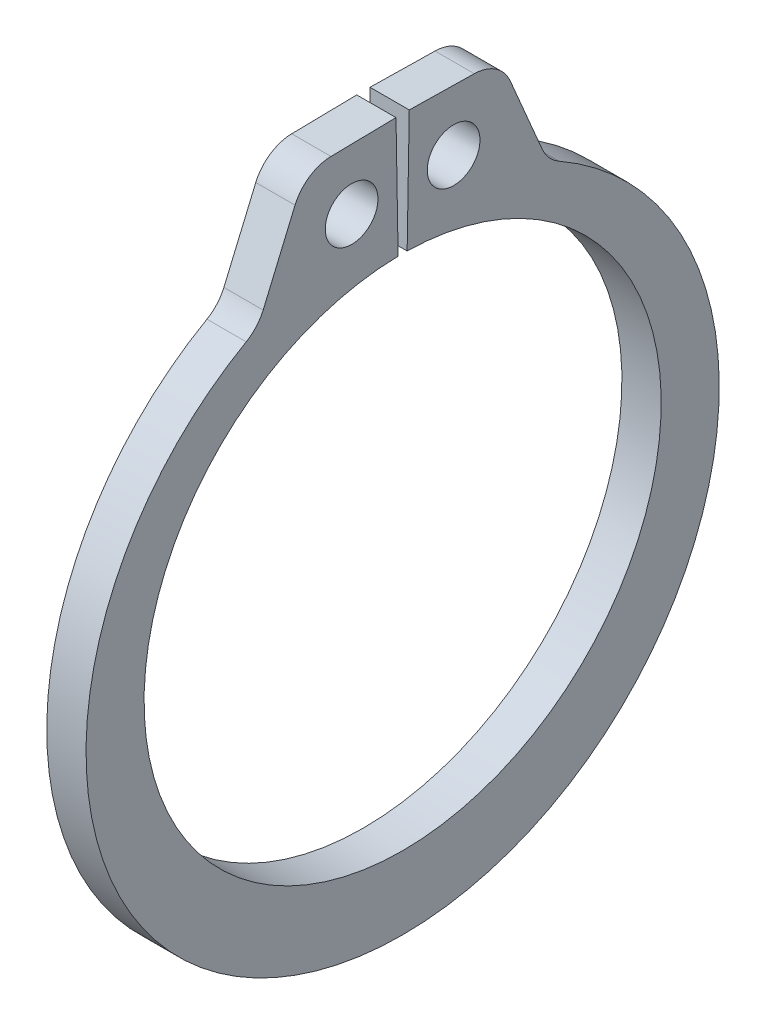
ISO-10303-21;
HEADER;
FILE_DESCRIPTION(('STEP AP214'),'2;1');
FILE_NAME('part.step','',(''),(''),'','','');
FILE_SCHEMA(('AUTOMOTIVE_DESIGN { 1 0 10303 214 1 1 1 1 }'));
ENDSEC;
DATA;
#1=APPLICATION_CONTEXT('core data for automotive mechanical design processes');
#2=APPLICATION_PROTOCOL_DEFINITION('international standard','automotive_design',2000,#1);
#3=PRODUCT_CONTEXT('',#1,'mechanical');
#4=PRODUCT('Part','Part','',(#3));
#5=PRODUCT_RELATED_PRODUCT_CATEGORY('part','',(#4));
#6=PRODUCT_DEFINITION_FORMATION('','',#4);
#7=PRODUCT_DEFINITION_CONTEXT('part definition',#1,'design');
#8=PRODUCT_DEFINITION('design','',#6,#7);
#9=PRODUCT_DEFINITION_SHAPE('','',#8);
#10=(LENGTH_UNIT() NAMED_UNIT(*) SI_UNIT(.MILLI.,.METRE.));
#11=(NAMED_UNIT(*) PLANE_ANGLE_UNIT() SI_UNIT($,.RADIAN.));
#12=(NAMED_UNIT(*) SI_UNIT($,.STERADIAN.) SOLID_ANGLE_UNIT());
#13=UNCERTAINTY_MEASURE_WITH_UNIT(LENGTH_MEASURE(1.E-05),#10,'distance_accuracy_value','');
#14=(GEOMETRIC_REPRESENTATION_CONTEXT(3) GLOBAL_UNCERTAINTY_ASSIGNED_CONTEXT((#13)) GLOBAL_UNIT_ASSIGNED_CONTEXT((#10,
#11,#12)) REPRESENTATION_CONTEXT('',''));
#15=CARTESIAN_POINT('',(0.,0.,0.));
#16=DIRECTION('',(0.,0.,1.));
#17=DIRECTION('',(1.,0.,0.));
#18=AXIS2_PLACEMENT_3D('',#15,#16,#17);
#19=CARTESIAN_POINT('',(-0.4445,0.,0.));
#20=DIRECTION('',(1.,0.,0.));
#21=DIRECTION('',(0.,0.,-1.));
#22=AXIS2_PLACEMENT_3D('',#19,#20,#21);
#23=PLANE('',#22);
#24=CARTESIAN_POINT('',(-0.4445,7.20724610900658,-1.15465964864512));
#25=DIRECTION('',(-1.,0.,0.));
#26=DIRECTION('',(0.,0.,1.));
#27=AXIS2_PLACEMENT_3D('',#24,#25,#26);
#28=CIRCLE('',#27,0.5969);
#29=CARTESIAN_POINT('',(-0.4445,7.20724610900658,-0.557759648645124));
#30=VERTEX_POINT('',#29);
#31=EDGE_CURVE('E134',#30,#30,#28,.F.);
#32=ORIENTED_EDGE('',*,*,#31,.T.);
#33=EDGE_LOOP('',(#32));
#34=FACE_BOUND('',#33,.T.);
#35=CARTESIAN_POINT('',(-0.4445,7.66933071962558,1.60650376158788));
#36=DIRECTION('',(-1.,0.,0.));
#37=DIRECTION('',(0.,0.,1.));
#38=AXIS2_PLACEMENT_3D('',#35,#36,#37);
#39=CIRCLE('',#38,0.9017);
#40=CARTESIAN_POINT('',(-0.4445,8.5708933863481,1.62224059647238));
#41=VERTEX_POINT('',#40);
#42=CARTESIAN_POINT('',(-0.4445,8.02240621636442,2.43620285379096));
#43=VERTEX_POINT('',#42);
#44=EDGE_CURVE('E104',#41,#43,#39,.F.);
#45=ORIENTED_EDGE('',*,*,#44,.F.);
#46=DIRECTION('',(0.,0.01745240643729,-0.999847695156391));
#47=VECTOR('',#46,1.);
#48=CARTESIAN_POINT('',(-0.4445,8.59659049818515,0.15005404530712));
#49=LINE('',#48,#47);
#50=CARTESIAN_POINT('',(-0.4445,8.59659049818515,0.15005404530712));
#51=VERTEX_POINT('',#50);
#52=EDGE_CURVE('E99',#41,#51,#49,.T.);
#53=ORIENTED_EDGE('',*,*,#52,.T.);
#54=DIRECTION('',(0.,-0.999847695156391,-0.0174524064372833));
#55=VECTOR('',#54,1.);
#56=CARTESIAN_POINT('',(-0.4445,5.85380830083213,0.102178603968365));
#57=LINE('',#56,#55);
#58=CARTESIAN_POINT('',(-0.4445,5.85380830083213,0.102178603968365));
#59=VERTEX_POINT('',#58);
#60=EDGE_CURVE('E131',#51,#59,#57,.T.);
#61=ORIENTED_EDGE('',*,*,#60,.T.);
#62=CARTESIAN_POINT('',(-0.4445,0.,0.));
#63=DIRECTION('',(-1.,0.,0.));
#64=DIRECTION('',(0.,0.,1.));
#65=AXIS2_PLACEMENT_3D('',#62,#63,#64);
#66=CIRCLE('',#65,5.8547);
#67=CARTESIAN_POINT('',(-0.4445,5.85380830083213,-0.102178603968365));
#68=VERTEX_POINT('',#67);
#69=EDGE_CURVE('E181',#59,#68,#66,.F.);
#70=ORIENTED_EDGE('',*,*,#69,.T.);
#71=DIRECTION('',(0.,0.999847695156391,-0.0174524064372833));
#72=VECTOR('',#71,1.);
#73=CARTESIAN_POINT('',(-0.4445,5.85380830083213,-0.102178603968365));
#74=LINE('',#73,#72);
#75=CARTESIAN_POINT('',(-0.4445,8.59659049818515,-0.15005404530712));
#76=VERTEX_POINT('',#75);
#77=EDGE_CURVE('E141',#68,#76,#74,.T.);
#78=ORIENTED_EDGE('',*,*,#77,.T.);
#79=DIRECTION('',(0.,-0.01745240643729,-0.999847695156391));
#80=VECTOR('',#79,1.);
#81=CARTESIAN_POINT('',(-0.4445,8.59659049818515,-0.15005404530712));
#82=LINE('',#81,#80);
#83=CARTESIAN_POINT('',(-0.4445,8.5708933863481,-1.62224059647238));
#84=VERTEX_POINT('',#83);
#85=EDGE_CURVE('E148',#76,#84,#82,.T.);
#86=ORIENTED_EDGE('',*,*,#85,.T.);
#87=CARTESIAN_POINT('',(-0.4445,7.66933071962558,-1.60650376158788));
#88=DIRECTION('',(-1.,0.,0.));
#89=DIRECTION('',(0.,0.,1.));
#90=AXIS2_PLACEMENT_3D('',#87,#88,#89);
#91=CIRCLE('',#90,0.9017);
#92=CARTESIAN_POINT('',(-0.4445,8.02240621636442,-2.43620285379096));
#93=VERTEX_POINT('',#92);
#94=EDGE_CURVE('E151',#93,#84,#91,.F.);
#95=ORIENTED_EDGE('',*,*,#94,.F.);
#96=DIRECTION('',(0.,-0.920149819455567,-0.391566481910656));
#97=VECTOR('',#96,1.);
#98=CARTESIAN_POINT('',(-0.4445,8.56068391718107,-2.20714069332188));
#99=LINE('',#98,#97);
#100=CARTESIAN_POINT('',(-0.4445,6.32616456625773,-3.15803245301383));
#101=VERTEX_POINT('',#100);
#102=EDGE_CURVE('E154',#93,#101,#99,.T.);
#103=ORIENTED_EDGE('',*,*,#102,.T.);
#104=CARTESIAN_POINT('',(-0.4445,6.67924006299657,-3.98773154521692));
#105=DIRECTION('',(-1.,0.,0.));
#106=DIRECTION('',(0.,0.,1.));
#107=AXIS2_PLACEMENT_3D('',#104,#105,#106);
#108=CIRCLE('',#107,0.9017);
#109=CARTESIAN_POINT('',(-0.4445,5.89530863003734,-3.54218199868087));
#110=VERTEX_POINT('',#109);
#111=EDGE_CURVE('E187',#101,#110,#108,.F.);
#112=ORIENTED_EDGE('',*,*,#111,.T.);
#113=CARTESIAN_POINT('',(-0.4445,-0.337057291142251,0.));
#114=DIRECTION('',(-1.,0.,0.));
#115=DIRECTION('',(0.,0.,1.));
#116=AXIS2_PLACEMENT_3D('',#113,#114,#115);
#117=CIRCLE('',#116,7.16864270885775);
#118=CARTESIAN_POINT('',(-0.4445,5.89530863003733,3.54218199868087));
#119=VERTEX_POINT('',#118);
#120=EDGE_CURVE('E189',#119,#110,#117,.F.);
#121=ORIENTED_EDGE('',*,*,#120,.F.);
#122=CARTESIAN_POINT('',(-0.4445,6.67924006299657,3.98773154521692));
#123=DIRECTION('',(-1.,0.,0.));
#124=DIRECTION('',(0.,0.,1.));
#125=AXIS2_PLACEMENT_3D('',#122,#123,#124);
#126=CIRCLE('',#125,0.9017);
#127=CARTESIAN_POINT('',(-0.4445,6.32616456625773,3.15803245301383));
#128=VERTEX_POINT('',#127);
#129=EDGE_CURVE('E117',#119,#128,#126,.F.);
#130=ORIENTED_EDGE('',*,*,#129,.T.);
#131=DIRECTION('',(0.,0.920149819455567,-0.391566481910656));
#132=VECTOR('',#131,1.);
#133=CARTESIAN_POINT('',(-0.4445,8.56068391718107,2.20714069332188));
#134=LINE('',#133,#132);
#135=EDGE_CURVE('E114',#128,#43,#134,.T.);
#136=ORIENTED_EDGE('',*,*,#135,.T.);
#137=EDGE_LOOP('',(#45,#53,#61,#70,#78,#86,#95,#103,#112,#121,#130,#136));
#138=FACE_BOUND('',#137,.T.);
#139=CARTESIAN_POINT('',(-0.4445,7.20724610900658,1.15465964864512));
#140=DIRECTION('',(-1.,0.,0.));
#141=DIRECTION('',(0.,0.,1.));
#142=AXIS2_PLACEMENT_3D('',#139,#140,#141);
#143=CIRCLE('',#142,0.5969);
#144=CARTESIAN_POINT('',(-0.4445,7.20724610900658,1.75155964864512));
#145=VERTEX_POINT('',#144);
#146=EDGE_CURVE('E21',#145,#145,#143,.F.);
#147=ORIENTED_EDGE('',*,*,#146,.T.);
#148=EDGE_LOOP('',(#147));
#149=FACE_BOUND('',#148,.T.);
#150=ADVANCED_FACE('F18',(#34,#138,#149),#23,.F.);
#151=CARTESIAN_POINT('',(0.4445,7.20724610900658,1.15465964864512));
#152=DIRECTION('',(-1.,0.,0.));
#153=DIRECTION('',(0.,0.,1.));
#154=AXIS2_PLACEMENT_3D('',#151,#152,#153);
#155=CYLINDRICAL_SURFACE('',#154,0.5969);
#156=CARTESIAN_POINT('',(0.4445,7.20724610900658,1.15465964864512));
#157=DIRECTION('',(-1.,0.,0.));
#158=DIRECTION('',(0.,0.,1.));
#159=AXIS2_PLACEMENT_3D('',#156,#157,#158);
#160=CIRCLE('',#159,0.5969);
#161=CARTESIAN_POINT('',(0.4445,7.20724610900658,1.75155964864512));
#162=VERTEX_POINT('',#161);
#163=EDGE_CURVE('E176',#162,#162,#160,.T.);
#164=ORIENTED_EDGE('',*,*,#163,.F.);
#165=EDGE_LOOP('',(#164));
#166=FACE_BOUND('',#165,.T.);
#167=ORIENTED_EDGE('',*,*,#146,.F.);
#168=EDGE_LOOP('',(#167));
#169=FACE_BOUND('',#168,.T.);
#170=ADVANCED_FACE('F361',(#166,#169),#155,.F.);
#171=CARTESIAN_POINT('',(0.4445,8.59659049818515,0.15005404530712));
#172=DIRECTION('',(0.,-0.999847695156391,-0.01745240643729));
#173=DIRECTION('',(0.,0.01745240643729,-0.999847695156391));
#174=AXIS2_PLACEMENT_3D('',#171,#172,#173);
#175=PLANE('',#174);
#176=DIRECTION('',(-1.,0.,0.));
#177=VECTOR('',#176,1.);
#178=CARTESIAN_POINT('',(0.4445,8.5708933863481,1.62224059647238));
#179=LINE('',#178,#177);
#180=CARTESIAN_POINT('',(0.4445,8.5708933863481,1.62224059647238));
#181=VERTEX_POINT('',#180);
#182=EDGE_CURVE('E111',#181,#41,#179,.T.);
#183=ORIENTED_EDGE('',*,*,#182,.F.);
#184=DIRECTION('',(0.,-0.0174524064372901,0.999847695156391));
#185=VECTOR('',#184,1.);
#186=CARTESIAN_POINT('',(0.4445,8.59659049818515,0.15005404530712));
#187=LINE('',#186,#185);
#188=CARTESIAN_POINT('',(0.4445,8.59659049818515,0.15005404530712));
#189=VERTEX_POINT('',#188);
#190=EDGE_CURVE('E175',#189,#181,#187,.T.);
#191=ORIENTED_EDGE('',*,*,#190,.F.);
#192=DIRECTION('',(1.,0.,0.));
#193=VECTOR('',#192,1.);
#194=CARTESIAN_POINT('',(0.4445,8.59659049818515,0.15005404530712));
#195=LINE('',#194,#193);
#196=EDGE_CURVE('E135',#189,#51,#195,.F.);
#197=ORIENTED_EDGE('',*,*,#196,.T.);
#198=ORIENTED_EDGE('',*,*,#52,.F.);
#199=EDGE_LOOP('',(#183,#191,#197,#198));
#200=FACE_BOUND('',#199,.T.);
#201=ADVANCED_FACE('F239',(#200),#175,.F.);
#202=CARTESIAN_POINT('',(0.4445,7.66933071962558,1.60650376158788));
#203=DIRECTION('',(-1.,0.,0.));
#204=DIRECTION('',(0.,0.,1.));
#205=AXIS2_PLACEMENT_3D('',#202,#203,#204);
#206=CYLINDRICAL_SURFACE('',#205,0.9017);
#207=ORIENTED_EDGE('',*,*,#44,.T.);
#208=DIRECTION('',(1.,0.,0.));
#209=VECTOR('',#208,1.);
#210=CARTESIAN_POINT('',(0.4445,8.02240621636442,2.43620285379096));
#211=LINE('',#210,#209);
#212=CARTESIAN_POINT('',(0.4445,8.02240621636442,2.43620285379096));
#213=VERTEX_POINT('',#212);
#214=EDGE_CURVE('E109',#43,#213,#211,.T.);
#215=ORIENTED_EDGE('',*,*,#214,.T.);
#216=CARTESIAN_POINT('',(0.4445,7.66933071962558,1.60650376158788));
#217=DIRECTION('',(-1.,0.,0.));
#218=DIRECTION('',(0.,0.,1.));
#219=AXIS2_PLACEMENT_3D('',#216,#217,#218);
#220=CIRCLE('',#219,0.9017);
#221=EDGE_CURVE('E173',#181,#213,#220,.F.);
#222=ORIENTED_EDGE('',*,*,#221,.F.);
#223=ORIENTED_EDGE('',*,*,#182,.T.);
#224=EDGE_LOOP('',(#207,#215,#222,#223));
#225=FACE_BOUND('',#224,.T.);
#226=ADVANCED_FACE('F106',(#225),#206,.T.);
#227=CARTESIAN_POINT('',(0.4445,8.56068391718107,2.20714069332188));
#228=DIRECTION('',(0.,-0.391566481910656,-0.920149819455567));
#229=DIRECTION('',(0.,0.920149819455567,-0.391566481910656));
#230=AXIS2_PLACEMENT_3D('',#227,#228,#229);
#231=PLANE('',#230);
#232=DIRECTION('',(-1.,0.,0.));
#233=VECTOR('',#232,1.);
#234=CARTESIAN_POINT('',(0.4445,6.32616456625773,3.15803245301383));
#235=LINE('',#234,#233);
#236=CARTESIAN_POINT('',(0.4445,6.32616456625773,3.15803245301383));
#237=VERTEX_POINT('',#236);
#238=EDGE_CURVE('E128',#128,#237,#235,.F.);
#239=ORIENTED_EDGE('',*,*,#238,.T.);
#240=DIRECTION('',(0.,-0.920149819455566,0.391566481910657));
#241=VECTOR('',#240,1.);
#242=CARTESIAN_POINT('',(0.4445,8.02240621636442,2.43620285379096));
#243=LINE('',#242,#241);
#244=EDGE_CURVE('E123',#213,#237,#243,.T.);
#245=ORIENTED_EDGE('',*,*,#244,.F.);
#246=ORIENTED_EDGE('',*,*,#214,.F.);
#247=ORIENTED_EDGE('',*,*,#135,.F.);
#248=EDGE_LOOP('',(#239,#245,#246,#247));
#249=FACE_BOUND('',#248,.T.);
#250=ADVANCED_FACE('F121',(#249),#231,.F.);
#251=CARTESIAN_POINT('',(0.4445,6.67924006299657,3.98773154521692));
#252=DIRECTION('',(-1.,0.,0.));
#253=DIRECTION('',(0.,0.,1.));
#254=AXIS2_PLACEMENT_3D('',#251,#252,#253);
#255=CYLINDRICAL_SURFACE('',#254,0.9017);
#256=ORIENTED_EDGE('',*,*,#238,.F.);
#257=ORIENTED_EDGE('',*,*,#129,.F.);
#258=DIRECTION('',(-1.,0.,0.));
#259=VECTOR('',#258,1.);
#260=CARTESIAN_POINT('',(0.4445,5.89530863003733,3.54218199868087));
#261=LINE('',#260,#259);
#262=CARTESIAN_POINT('',(0.4445,5.89530863003733,3.54218199868087));
#263=VERTEX_POINT('',#262);
#264=EDGE_CURVE('E192',#263,#119,#261,.T.);
#265=ORIENTED_EDGE('',*,*,#264,.F.);
#266=CARTESIAN_POINT('',(0.4445,6.67924006299657,3.98773154521692));
#267=DIRECTION('',(-1.,0.,0.));
#268=DIRECTION('',(0.,0.,1.));
#269=AXIS2_PLACEMENT_3D('',#266,#267,#268);
#270=CIRCLE('',#269,0.9017);
#271=EDGE_CURVE('E170',#237,#263,#270,.T.);
#272=ORIENTED_EDGE('',*,*,#271,.F.);
#273=EDGE_LOOP('',(#256,#257,#265,#272));
#274=FACE_BOUND('',#273,.T.);
#275=ADVANCED_FACE('F269',(#274),#255,.F.);
#276=CARTESIAN_POINT('',(0.4445,-0.337057291142251,0.));
#277=DIRECTION('',(-1.,0.,0.));
#278=DIRECTION('',(0.,0.,1.));
#279=AXIS2_PLACEMENT_3D('',#276,#277,#278);
#280=CYLINDRICAL_SURFACE('',#279,7.16864270885775);
#281=ORIENTED_EDGE('',*,*,#120,.T.);
#282=DIRECTION('',(-1.,0.,0.));
#283=VECTOR('',#282,1.);
#284=CARTESIAN_POINT('',(0.4445,5.89530863003733,-3.54218199868087));
#285=LINE('',#284,#283);
#286=CARTESIAN_POINT('',(0.4445,5.89530863003734,-3.54218199868087));
#287=VERTEX_POINT('',#286);
#288=EDGE_CURVE('E156',#110,#287,#285,.F.);
#289=ORIENTED_EDGE('',*,*,#288,.T.);
#290=CARTESIAN_POINT('',(0.4445,-0.337057291142251,0.));
#291=DIRECTION('',(-1.,0.,0.));
#292=DIRECTION('',(0.,0.,1.));
#293=AXIS2_PLACEMENT_3D('',#290,#291,#292);
#294=CIRCLE('',#293,7.16864270885775);
#295=EDGE_CURVE('E168',#263,#287,#294,.F.);
#296=ORIENTED_EDGE('',*,*,#295,.F.);
#297=ORIENTED_EDGE('',*,*,#264,.T.);
#298=EDGE_LOOP('',(#281,#289,#296,#297));
#299=FACE_BOUND('',#298,.T.);
#300=ADVANCED_FACE('F267',(#299),#280,.T.);
#301=CARTESIAN_POINT('',(0.4445,6.67924006299657,-3.98773154521692));
#302=DIRECTION('',(-1.,0.,0.));
#303=DIRECTION('',(0.,0.,1.));
#304=AXIS2_PLACEMENT_3D('',#301,#302,#303);
#305=CYLINDRICAL_SURFACE('',#304,0.9017);
#306=ORIENTED_EDGE('',*,*,#288,.F.);
#307=ORIENTED_EDGE('',*,*,#111,.F.);
#308=DIRECTION('',(1.,0.,0.));
#309=VECTOR('',#308,1.);
#310=CARTESIAN_POINT('',(0.4445,6.32616456625773,-3.15803245301383));
#311=LINE('',#310,#309);
#312=CARTESIAN_POINT('',(0.4445,6.32616456625773,-3.15803245301383));
#313=VERTEX_POINT('',#312);
#314=EDGE_CURVE('E155',#101,#313,#311,.T.);
#315=ORIENTED_EDGE('',*,*,#314,.T.);
#316=CARTESIAN_POINT('',(0.4445,6.67924006299657,-3.98773154521692));
#317=DIRECTION('',(-1.,0.,0.));
#318=DIRECTION('',(0.,0.,1.));
#319=AXIS2_PLACEMENT_3D('',#316,#317,#318);
#320=CIRCLE('',#319,0.9017);
#321=EDGE_CURVE('E165',#287,#313,#320,.T.);
#322=ORIENTED_EDGE('',*,*,#321,.F.);
#323=EDGE_LOOP('',(#306,#307,#315,#322));
#324=FACE_BOUND('',#323,.T.);
#325=ADVANCED_FACE('F265',(#324),#305,.F.);
#326=CARTESIAN_POINT('',(0.4445,8.56068391718107,-2.20714069332188));
#327=DIRECTION('',(0.,-0.391566481910656,0.920149819455567));
#328=DIRECTION('',(0.,-0.920149819455567,-0.391566481910656));
#329=AXIS2_PLACEMENT_3D('',#326,#327,#328);
#330=PLANE('',#329);
#331=ORIENTED_EDGE('',*,*,#314,.F.);
#332=ORIENTED_EDGE('',*,*,#102,.F.);
#333=DIRECTION('',(-1.,0.,0.));
#334=VECTOR('',#333,1.);
#335=CARTESIAN_POINT('',(0.4445,8.02240621636442,-2.43620285379096));
#336=LINE('',#335,#334);
#337=CARTESIAN_POINT('',(0.4445,8.02240621636442,-2.43620285379096));
#338=VERTEX_POINT('',#337);
#339=EDGE_CURVE('E186',#338,#93,#336,.T.);
#340=ORIENTED_EDGE('',*,*,#339,.F.);
#341=DIRECTION('',(0.,0.920149819455566,0.391566481910657));
#342=VECTOR('',#341,1.);
#343=CARTESIAN_POINT('',(0.4445,6.32616456625773,-3.15803245301383));
#344=LINE('',#343,#342);
#345=EDGE_CURVE('E164',#313,#338,#344,.T.);
#346=ORIENTED_EDGE('',*,*,#345,.F.);
#347=EDGE_LOOP('',(#331,#332,#340,#346));
#348=FACE_BOUND('',#347,.T.);
#349=ADVANCED_FACE('F261',(#348),#330,.F.);
#350=CARTESIAN_POINT('',(0.4445,7.66933071962558,-1.60650376158788));
#351=DIRECTION('',(-1.,0.,0.));
#352=DIRECTION('',(0.,0.,1.));
#353=AXIS2_PLACEMENT_3D('',#350,#351,#352);
#354=CYLINDRICAL_SURFACE('',#353,0.9017);
#355=ORIENTED_EDGE('',*,*,#94,.T.);
#356=DIRECTION('',(1.,0.,0.));
#357=VECTOR('',#356,1.);
#358=CARTESIAN_POINT('',(0.4445,8.5708933863481,-1.62224059647238));
#359=LINE('',#358,#357);
#360=CARTESIAN_POINT('',(0.4445,8.5708933863481,-1.62224059647238));
#361=VERTEX_POINT('',#360);
#362=EDGE_CURVE('E150',#84,#361,#359,.T.);
#363=ORIENTED_EDGE('',*,*,#362,.T.);
#364=CARTESIAN_POINT('',(0.4445,7.66933071962558,-1.60650376158788));
#365=DIRECTION('',(-1.,0.,0.));
#366=DIRECTION('',(0.,0.,1.));
#367=AXIS2_PLACEMENT_3D('',#364,#365,#366);
#368=CIRCLE('',#367,0.9017);
#369=EDGE_CURVE('E160',#338,#361,#368,.F.);
#370=ORIENTED_EDGE('',*,*,#369,.F.);
#371=ORIENTED_EDGE('',*,*,#339,.T.);
#372=EDGE_LOOP('',(#355,#363,#370,#371));
#373=FACE_BOUND('',#372,.T.);
#374=ADVANCED_FACE('F256',(#373),#354,.T.);
#375=CARTESIAN_POINT('',(0.4445,8.59659049818515,-0.15005404530712));
#376=DIRECTION('',(0.,-0.999847695156391,0.01745240643729));
#377=DIRECTION('',(0.,-0.01745240643729,-0.999847695156391));
#378=AXIS2_PLACEMENT_3D('',#375,#376,#377);
#379=PLANE('',#378);
#380=ORIENTED_EDGE('',*,*,#362,.F.);
#381=ORIENTED_EDGE('',*,*,#85,.F.);
#382=DIRECTION('',(1.,0.,0.));
#383=VECTOR('',#382,1.);
#384=CARTESIAN_POINT('',(0.4445,8.59659049818515,-0.15005404530712));
#385=LINE('',#384,#383);
#386=CARTESIAN_POINT('',(0.4445,8.59659049818515,-0.15005404530712));
#387=VERTEX_POINT('',#386);
#388=EDGE_CURVE('E145',#76,#387,#385,.T.);
#389=ORIENTED_EDGE('',*,*,#388,.T.);
#390=DIRECTION('',(0.,0.0174524064372901,0.999847695156391));
#391=VECTOR('',#390,1.);
#392=CARTESIAN_POINT('',(0.4445,8.5708933863481,-1.62224059647238));
#393=LINE('',#392,#391);
#394=EDGE_CURVE('E163',#361,#387,#393,.T.);
#395=ORIENTED_EDGE('',*,*,#394,.F.);
#396=EDGE_LOOP('',(#380,#381,#389,#395));
#397=FACE_BOUND('',#396,.T.);
#398=ADVANCED_FACE('F253',(#397),#379,.F.);
#399=CARTESIAN_POINT('',(0.4445,5.85380830083213,-0.102178603968365));
#400=DIRECTION('',(0.,-0.0174524064372833,-0.999847695156391));
#401=DIRECTION('',(0.,0.999847695156391,-0.0174524064372833));
#402=AXIS2_PLACEMENT_3D('',#399,#400,#401);
#403=PLANE('',#402);
#404=DIRECTION('',(-1.,0.,0.));
#405=VECTOR('',#404,1.);
#406=CARTESIAN_POINT('',(0.4445,5.85380830083213,-0.102178603968365));
#407=LINE('',#406,#405);
#408=CARTESIAN_POINT('',(0.4445,5.85380830083213,-0.102178603968365));
#409=VERTEX_POINT('',#408);
#410=EDGE_CURVE('E144',#68,#409,#407,.F.);
#411=ORIENTED_EDGE('',*,*,#410,.T.);
#412=DIRECTION('',(0.,-0.999847695156391,0.0174524064372833));
#413=VECTOR('',#412,1.);
#414=CARTESIAN_POINT('',(0.4445,8.59659049818515,-0.15005404530712));
#415=LINE('',#414,#413);
#416=EDGE_CURVE('E159',#387,#409,#415,.T.);
#417=ORIENTED_EDGE('',*,*,#416,.F.);
#418=ORIENTED_EDGE('',*,*,#388,.F.);
#419=ORIENTED_EDGE('',*,*,#77,.F.);
#420=EDGE_LOOP('',(#411,#417,#418,#419));
#421=FACE_BOUND('',#420,.T.);
#422=ADVANCED_FACE('F245',(#421),#403,.F.);
#423=CARTESIAN_POINT('',(0.4445,0.,0.));
#424=DIRECTION('',(-1.,0.,0.));
#425=DIRECTION('',(0.,0.,1.));
#426=AXIS2_PLACEMENT_3D('',#423,#424,#425);
#427=CYLINDRICAL_SURFACE('',#426,5.8547);
#428=DIRECTION('',(1.,0.,0.));
#429=VECTOR('',#428,1.);
#430=CARTESIAN_POINT('',(0.4445,5.85380830083213,0.102178603968365));
#431=LINE('',#430,#429);
#432=CARTESIAN_POINT('',(0.4445,5.85380830083213,0.102178603968365));
#433=VERTEX_POINT('',#432);
#434=EDGE_CURVE('E183',#59,#433,#431,.T.);
#435=ORIENTED_EDGE('',*,*,#434,.T.);
#436=CARTESIAN_POINT('',(0.4445,0.,0.));
#437=DIRECTION('',(-1.,0.,0.));
#438=DIRECTION('',(0.,0.,1.));
#439=AXIS2_PLACEMENT_3D('',#436,#437,#438);
#440=CIRCLE('',#439,5.8547);
#441=EDGE_CURVE('E36',#409,#433,#440,.T.);
#442=ORIENTED_EDGE('',*,*,#441,.F.);
#443=ORIENTED_EDGE('',*,*,#410,.F.);
#444=ORIENTED_EDGE('',*,*,#69,.F.);
#445=EDGE_LOOP('',(#435,#442,#443,#444));
#446=FACE_BOUND('',#445,.T.);
#447=ADVANCED_FACE('F247',(#446),#427,.F.);
#448=CARTESIAN_POINT('',(0.4445,5.85380830083213,0.102178603968365));
#449=DIRECTION('',(0.,-0.0174524064372833,0.999847695156391));
#450=DIRECTION('',(0.,-0.999847695156391,-0.0174524064372833));
#451=AXIS2_PLACEMENT_3D('',#448,#449,#450);
#452=PLANE('',#451);
#453=ORIENTED_EDGE('',*,*,#196,.F.);
#454=DIRECTION('',(0.,0.999847695156391,0.0174524064372833));
#455=VECTOR('',#454,1.);
#456=CARTESIAN_POINT('',(0.4445,5.85380830083213,0.102178603968365));
#457=LINE('',#456,#455);
#458=EDGE_CURVE('E27',#433,#189,#457,.T.);
#459=ORIENTED_EDGE('',*,*,#458,.F.);
#460=ORIENTED_EDGE('',*,*,#434,.F.);
#461=ORIENTED_EDGE('',*,*,#60,.F.);
#462=EDGE_LOOP('',(#453,#459,#460,#461));
#463=FACE_BOUND('',#462,.T.);
#464=ADVANCED_FACE('F237',(#463),#452,.F.);
#465=CARTESIAN_POINT('',(0.4445,7.20724610900658,-1.15465964864512));
#466=DIRECTION('',(-1.,0.,0.));
#467=DIRECTION('',(0.,0.,1.));
#468=AXIS2_PLACEMENT_3D('',#465,#466,#467);
#469=CYLINDRICAL_SURFACE('',#468,0.5969);
#470=CARTESIAN_POINT('',(0.4445,7.20724610900658,-1.15465964864512));
#471=DIRECTION('',(-1.,0.,0.));
#472=DIRECTION('',(0.,0.,1.));
#473=AXIS2_PLACEMENT_3D('',#470,#471,#472);
#474=CIRCLE('',#473,0.5969);
#475=CARTESIAN_POINT('',(0.4445,7.20724610900658,-0.557759648645124));
#476=VERTEX_POINT('',#475);
#477=EDGE_CURVE('E11',#476,#476,#474,.T.);
#478=ORIENTED_EDGE('',*,*,#477,.F.);
#479=EDGE_LOOP('',(#478));
#480=FACE_BOUND('',#479,.T.);
#481=ORIENTED_EDGE('',*,*,#31,.F.);
#482=EDGE_LOOP('',(#481));
#483=FACE_BOUND('',#482,.T.);
#484=ADVANCED_FACE('F280',(#480,#483),#469,.F.);
#485=CARTESIAN_POINT('',(0.4445,0.,0.));
#486=DIRECTION('',(1.,0.,0.));
#487=DIRECTION('',(0.,0.,-1.));
#488=AXIS2_PLACEMENT_3D('',#485,#486,#487);
#489=PLANE('',#488);
#490=ORIENTED_EDGE('',*,*,#477,.T.);
#491=EDGE_LOOP('',(#490));
#492=FACE_BOUND('',#491,.T.);
#493=ORIENTED_EDGE('',*,*,#441,.T.);
#494=ORIENTED_EDGE('',*,*,#458,.T.);
#495=ORIENTED_EDGE('',*,*,#190,.T.);
#496=ORIENTED_EDGE('',*,*,#221,.T.);
#497=ORIENTED_EDGE('',*,*,#244,.T.);
#498=ORIENTED_EDGE('',*,*,#271,.T.);
#499=ORIENTED_EDGE('',*,*,#295,.T.);
#500=ORIENTED_EDGE('',*,*,#321,.T.);
#501=ORIENTED_EDGE('',*,*,#345,.T.);
#502=ORIENTED_EDGE('',*,*,#369,.T.);
#503=ORIENTED_EDGE('',*,*,#394,.T.);
#504=ORIENTED_EDGE('',*,*,#416,.T.);
#505=EDGE_LOOP('',(#493,#494,#495,#496,#497,#498,#499,#500,#501,#502,#503,#504));
#506=FACE_BOUND('',#505,.T.);
#507=ORIENTED_EDGE('',*,*,#163,.T.);
#508=EDGE_LOOP('',(#507));
#509=FACE_BOUND('',#508,.T.);
#510=ADVANCED_FACE('F230',(#492,#506,#509),#489,.T.);
#511=CLOSED_SHELL('',(#150,#170,#201,#226,#250,#275,#300,#325,#349,#374,#398,#422,#447,#464,
#484,#510));
#512=MANIFOLD_SOLID_BREP('B1',#511);
#513=ADVANCED_BREP_SHAPE_REPRESENTATION('',(#18,#512),#14);
#514=SHAPE_DEFINITION_REPRESENTATION(#9,#513);
ENDSEC;
END-ISO-10303-21;
